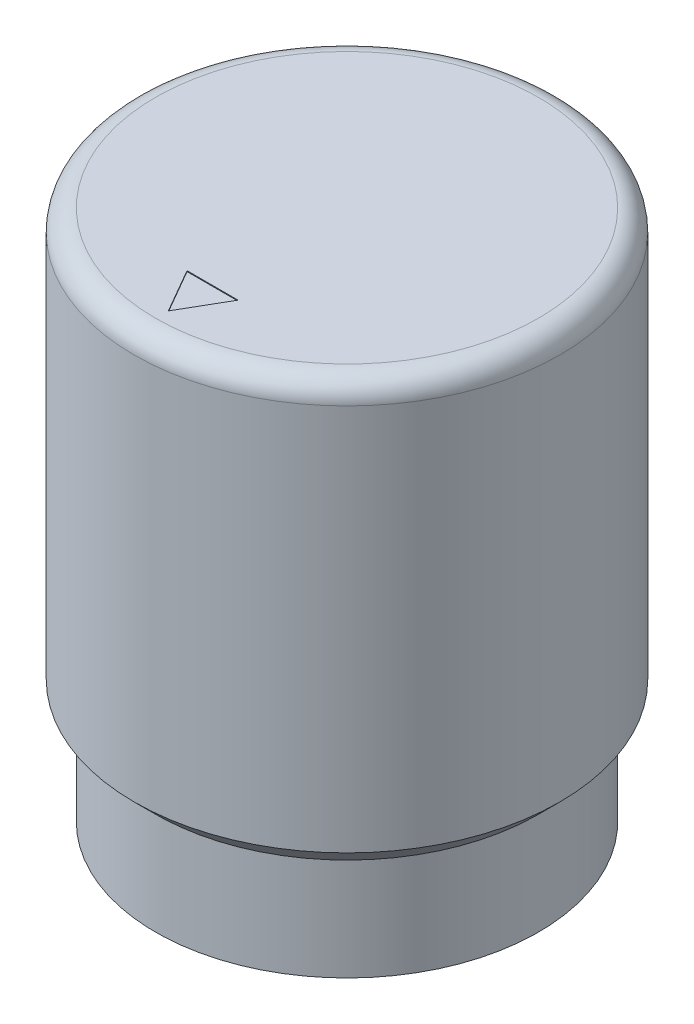
ISO-10303-21;
HEADER;
FILE_DESCRIPTION(('STEP AP214'),'2;1');
FILE_NAME('part.step','',(''),(''),'','','');
FILE_SCHEMA(('AUTOMOTIVE_DESIGN { 1 0 10303 214 1 1 1 1 }'));
ENDSEC;
DATA;
#1=APPLICATION_CONTEXT('core data for automotive mechanical design processes');
#2=APPLICATION_PROTOCOL_DEFINITION('international standard','automotive_design',2000,#1);
#3=PRODUCT_CONTEXT('',#1,'mechanical');
#4=PRODUCT('Part','Part','',(#3));
#5=PRODUCT_RELATED_PRODUCT_CATEGORY('part','',(#4));
#6=PRODUCT_DEFINITION_FORMATION('','',#4);
#7=PRODUCT_DEFINITION_CONTEXT('part definition',#1,'design');
#8=PRODUCT_DEFINITION('design','',#6,#7);
#9=PRODUCT_DEFINITION_SHAPE('','',#8);
#10=(LENGTH_UNIT() NAMED_UNIT(*) SI_UNIT(.MILLI.,.METRE.));
#11=(NAMED_UNIT(*) PLANE_ANGLE_UNIT() SI_UNIT($,.RADIAN.));
#12=(NAMED_UNIT(*) SI_UNIT($,.STERADIAN.) SOLID_ANGLE_UNIT());
#13=UNCERTAINTY_MEASURE_WITH_UNIT(LENGTH_MEASURE(1.E-05),#10,'distance_accuracy_value','');
#14=(GEOMETRIC_REPRESENTATION_CONTEXT(3) GLOBAL_UNCERTAINTY_ASSIGNED_CONTEXT((#13)) GLOBAL_UNIT_ASSIGNED_CONTEXT((#10,
#11,#12)) REPRESENTATION_CONTEXT('',''));
#15=CARTESIAN_POINT('',(0.,0.,0.));
#16=DIRECTION('',(0.,0.,1.));
#17=DIRECTION('',(1.,0.,0.));
#18=AXIS2_PLACEMENT_3D('',#15,#16,#17);
#19=CARTESIAN_POINT('',(0.,15.875,0.));
#20=DIRECTION('',(0.,1.,0.));
#21=DIRECTION('',(0.,0.,1.));
#22=AXIS2_PLACEMENT_3D('',#19,#20,#21);
#23=PLANE('',#22);
#24=DIRECTION('',(0.5,0.,-0.866025403784438));
#25=VECTOR('',#24,1.);
#26=CARTESIAN_POINT('',(0.762,15.875,4.01417728463252));
#27=LINE('',#26,#25);
#28=CARTESIAN_POINT('',(0.,15.875,5.334));
#29=VERTEX_POINT('',#28);
#30=CARTESIAN_POINT('',(0.762,15.875,4.01417728463252));
#31=VERTEX_POINT('',#30);
#32=EDGE_CURVE('E54',#29,#31,#27,.T.);
#33=ORIENTED_EDGE('',*,*,#32,.F.);
#34=DIRECTION('',(0.5,0.,0.866025403784438));
#35=VECTOR('',#34,1.);
#36=CARTESIAN_POINT('',(0.,15.875,5.334));
#37=LINE('',#36,#35);
#38=CARTESIAN_POINT('',(-0.762,15.875,4.01417728463252));
#39=VERTEX_POINT('',#38);
#40=EDGE_CURVE('E91',#39,#29,#37,.T.);
#41=ORIENTED_EDGE('',*,*,#40,.F.);
#42=DIRECTION('',(-1.,0.,0.));
#43=VECTOR('',#42,1.);
#44=CARTESIAN_POINT('',(-0.762,15.875,4.01417728463252));
#45=LINE('',#44,#43);
#46=EDGE_CURVE('E94',#31,#39,#45,.T.);
#47=ORIENTED_EDGE('',*,*,#46,.F.);
#48=EDGE_LOOP('',(#33,#41,#47));
#49=FACE_BOUND('',#48,.T.);
#50=CARTESIAN_POINT('',(0.,15.875,0.));
#51=DIRECTION('',(0.,1.,0.));
#52=DIRECTION('',(0.,0.,1.));
#53=AXIS2_PLACEMENT_3D('',#50,#51,#52);
#54=CIRCLE('',#53,5.715);
#55=CARTESIAN_POINT('',(0.,15.875,5.715));
#56=VERTEX_POINT('',#55);
#57=EDGE_CURVE('E11',#56,#56,#54,.T.);
#58=ORIENTED_EDGE('',*,*,#57,.T.);
#59=EDGE_LOOP('',(#58));
#60=FACE_BOUND('',#59,.T.);
#61=ADVANCED_FACE('F39',(#49,#60),#23,.T.);
#62=CARTESIAN_POINT('',(0.,0.,0.));
#63=DIRECTION('',(0.,-1.,0.));
#64=DIRECTION('',(0.,0.,-1.));
#65=AXIS2_PLACEMENT_3D('',#62,#63,#64);
#66=CYLINDRICAL_SURFACE('',#65,6.35);
#67=CARTESIAN_POINT('',(0.,15.24,0.));
#68=DIRECTION('',(0.,1.,0.));
#69=DIRECTION('',(0.,0.,1.));
#70=AXIS2_PLACEMENT_3D('',#67,#68,#69);
#71=CIRCLE('',#70,6.35);
#72=CARTESIAN_POINT('',(0.,15.24,6.35));
#73=VERTEX_POINT('',#72);
#74=EDGE_CURVE('E47',#73,#73,#71,.F.);
#75=ORIENTED_EDGE('',*,*,#74,.T.);
#76=EDGE_LOOP('',(#75));
#77=FACE_BOUND('',#76,.T.);
#78=CARTESIAN_POINT('',(0.,8.59155,-6.35));
#79=CARTESIAN_POINT('',(0.0750646140818434,8.59154737073417,-6.34999861096237));
#80=CARTESIAN_POINT('',(0.150161450028055,8.58527992657758,-6.34865540088408));
#81=CARTESIAN_POINT('',(0.298225296339674,8.56039984164008,-6.34342675076645));
#82=CARTESIAN_POINT('',(0.371190689529798,8.54177806894851,-6.33953943023363));
#83=CARTESIAN_POINT('',(0.512830125656907,8.492796439198,-6.32965577699744));
#84=CARTESIAN_POINT('',(0.581508452531715,8.46244852510907,-6.32366159067733));
#85=CARTESIAN_POINT('',(0.712795420037443,8.3909132358319,-6.31021261659612));
#86=CARTESIAN_POINT('',(0.77540428133116,8.34972625491349,-6.30275788196482));
#87=CARTESIAN_POINT('',(0.893733729529973,8.25701641240627,-6.28707845908267));
#88=CARTESIAN_POINT('',(0.949348399501573,8.20535989745548,-6.27884463503177));
#89=CARTESIAN_POINT('',(1.05119276861777,8.09346437873646,-6.26260005999281));
#90=CARTESIAN_POINT('',(1.09742166485733,8.03322464146688,-6.25458932813968));
#91=CARTESIAN_POINT('',(1.17964434517394,7.90509621196687,-6.23960815322762));
#92=CARTESIAN_POINT('',(1.21552634219633,7.837134290983,-6.23264943245589));
#93=CARTESIAN_POINT('',(1.27531989778063,7.69597282167515,-6.22069088315544));
#94=CARTESIAN_POINT('',(1.29923280847738,7.62277386604163,-6.21569083337163));
#95=CARTESIAN_POINT('',(1.33406128746238,7.47436223184559,-6.20830861045501));
#96=CARTESIAN_POINT('',(1.34516385912344,7.39919534927045,-6.20588881195717));
#97=CARTESIAN_POINT('',(1.35463777151121,7.24802984251258,-6.20382799290792));
#98=CARTESIAN_POINT('',(1.35301059361624,7.17203131613722,-6.20418664902391));
#99=CARTESIAN_POINT('',(1.33722190727113,7.02274306124383,-6.20760811333917));
#100=CARTESIAN_POINT('',(1.32327672735781,6.94942922291285,-6.2106242486392));
#101=CARTESIAN_POINT('',(1.28359022137343,6.80620610345467,-6.21894713261562));
#102=CARTESIAN_POINT('',(1.25784826428298,6.73629700467113,-6.22425400382448));
#103=CARTESIAN_POINT('',(1.19509780651165,6.60125487729554,-6.23660694361686));
#104=CARTESIAN_POINT('',(1.15800532064544,6.53616210229017,-6.24366590013669));
#105=CARTESIAN_POINT('',(1.07366584098501,6.41304430904634,-6.25871962533894));
#106=CARTESIAN_POINT('',(1.02641753096658,6.35502020845719,-6.2667145152598));
#107=CARTESIAN_POINT('',(0.921958343447951,6.24644048769627,-6.2829401548711));
#108=CARTESIAN_POINT('',(0.864563295807785,6.19606210282791,-6.29117238219288));
#109=CARTESIAN_POINT('',(0.742047254963458,6.10561794179964,-6.30679580872777));
#110=CARTESIAN_POINT('',(0.676926135506121,6.06555233419665,-6.31418699419339));
#111=CARTESIAN_POINT('',(0.5405963046733,5.99683073935462,-6.32731762757995));
#112=CARTESIAN_POINT('',(0.46937602644303,5.96819704156644,-6.33305384273191));
#113=CARTESIAN_POINT('',(0.322985870928896,5.92335198574641,-6.34220404917476));
#114=CARTESIAN_POINT('',(0.247816539193656,5.90713891664289,-6.34561836032498));
#115=CARTESIAN_POINT('',(0.0971831975907128,5.88785097050666,-6.34969483950221));
#116=CARTESIAN_POINT('',(0.0217515388494177,5.88453385095834,-6.35040774522148));
#117=CARTESIAN_POINT('',(-0.128588082469588,5.89047669974056,-6.34914287490065));
#118=CARTESIAN_POINT('',(-0.203496078330148,5.89973586130961,-6.34716527145521));
#119=CARTESIAN_POINT('',(-0.349866034457529,5.93036743385906,-6.34077352324428));
#120=CARTESIAN_POINT('',(-0.421355609891958,5.95161365582203,-6.33638477329703));
#121=CARTESIAN_POINT('',(-0.559756726901239,6.00547686686692,-6.32566160887462));
#122=CARTESIAN_POINT('',(-0.626667892088092,6.03809478946832,-6.319327034669));
#123=CARTESIAN_POINT('',(-0.755020804805226,6.11428628571363,-6.30528928586047));
#124=CARTESIAN_POINT('',(-0.816375459390216,6.1580032828613,-6.29756861532476));
#125=CARTESIAN_POINT('',(-0.930964829041667,6.2549621104687,-6.28165242253472));
#126=CARTESIAN_POINT('',(-0.984198546279221,6.3082051096557,-6.2734568420981));
#127=CARTESIAN_POINT('',(-1.08198553722146,6.42381349998989,-6.2573405892671));
#128=CARTESIAN_POINT('',(-1.1263715051453,6.48632160373991,-6.2494271894923));
#129=CARTESIAN_POINT('',(-1.20401575994887,6.61804773091925,-6.23493483661359));
#130=CARTESIAN_POINT('',(-1.23727451894148,6.68726546950682,-6.22835582689793));
#131=CARTESIAN_POINT('',(-1.29150180342355,6.83008031915002,-6.21733781696005));
#132=CARTESIAN_POINT('',(-1.31253798284658,6.90365079056797,-6.21288706126121));
#133=CARTESIAN_POINT('',(-1.34192355845653,7.05338861944233,-6.2066070485769));
#134=CARTESIAN_POINT('',(-1.35027486356241,7.12955558439385,-6.20477739714954));
#135=CARTESIAN_POINT('',(-1.35397567572369,7.28063973219357,-6.20397068907972));
#136=CARTESIAN_POINT('',(-1.34959015346798,7.35555023703136,-6.20493549674238));
#137=CARTESIAN_POINT('',(-1.32853178134123,7.50353887630111,-6.2094780181016));
#138=CARTESIAN_POINT('',(-1.31185906106091,7.57661703005012,-6.21305570424062));
#139=CARTESIAN_POINT('',(-1.26682455867663,7.71866923948335,-6.22239325528924));
#140=CARTESIAN_POINT('',(-1.23849943440763,7.78765539651984,-6.22814627217719));
#141=CARTESIAN_POINT('',(-1.17099639387991,7.91993635025732,-6.24118930990987));
#142=CARTESIAN_POINT('',(-1.13181741499343,7.98323058889684,-6.24847948123034));
#143=CARTESIAN_POINT('',(-1.04283172893201,8.10364141782745,-6.26395040356261));
#144=CARTESIAN_POINT('',(-0.992835380639868,8.16061603459636,-6.27214556837561));
#145=CARTESIAN_POINT('',(-0.884020822113276,8.26545398581748,-6.2884042122436));
#146=CARTESIAN_POINT('',(-0.825200580420684,8.31331521639077,-6.29646766049922));
#147=CARTESIAN_POINT('',(-0.699546337421048,8.39912290218367,-6.31167047796941));
#148=CARTESIAN_POINT('',(-0.632623562218123,8.43694167619792,-6.31879741398043));
#149=CARTESIAN_POINT('',(-0.493235348200114,8.50073467200623,-6.33120028356375));
#150=CARTESIAN_POINT('',(-0.420774730811316,8.52671906305292,-6.33647780542986));
#151=CARTESIAN_POINT('',(-0.2901768273112,8.56134743478013,-6.34361905124058));
#152=CARTESIAN_POINT('',(-0.232758269670466,8.57265224038747,-6.3459973461906));
#153=CARTESIAN_POINT('',(-0.11689962831609,8.58775439627314,-6.34918833005957));
#154=CARTESIAN_POINT('',(-0.058459585666748,8.59155204764645,-6.35000108176889));
#155=CARTESIAN_POINT('',(0.,8.59155,-6.35));
#156=B_SPLINE_CURVE_WITH_KNOTS('',3,(#78,#79,#80,#81,#82,#83,#84,#85,#86,#87,#88,#89,#90,#91,
#92,#93,#94,#95,#96,#97,#98,#99,#100,#101,#102,#103,#104,#105,#106,#107,#108,#109,#110,#111,
#112,#113,#114,#115,#116,#117,#118,#119,#120,#121,#122,#123,#124,#125,#126,#127,#128,#129,#130,
#131,#132,#133,#134,#135,#136,#137,#138,#139,#140,#141,#142,#143,#144,#145,#146,#147,#148,#149,
#150,#151,#152,#153,#154,#155),.UNSPECIFIED.,.T.,.F.,(4,2,2,2,2,2,2,2,2,2,2,2,2,2,2,2,2,2,2,2,2,
2,2,2,2,2,2,2,2,2,2,2,2,2,2,2,2,2,4),(0.,0.224979895980791,0.450126275209805,0.675043946749969,
0.899953438065849,1.12793886928433,1.355943795283,1.58632693132888,1.81668403536191,
2.04363409247309,2.27055773948938,2.49357367370591,2.71660153862233,2.94132126356156,
3.16607013040717,3.39542056996827,3.62477475790389,3.85457397221981,4.08434152359174,
4.3097715649296,4.53518714573762,4.75827288077634,4.98137693356216,5.20752538847284,
5.43370160816211,5.66381649384172,5.89392161481026,6.12274062574888,6.35152519880279,
6.57558456164185,6.79964156140387,7.02299901575426,7.24637834526044,7.47404733340156,
7.70176881671732,7.93226022587937,8.16255319898055,8.33777236451397,8.51298450226033),.UNSPECIFIED.);
#157=CARTESIAN_POINT('',(0.,8.59155,-6.35));
#158=VERTEX_POINT('',#157);
#159=EDGE_CURVE('E111',#158,#158,#156,.T.);
#160=ORIENTED_EDGE('',*,*,#159,.F.);
#161=EDGE_LOOP('',(#160));
#162=FACE_BOUND('',#161,.T.);
#163=CARTESIAN_POINT('',(0.,3.683,0.));
#164=DIRECTION('',(0.,-1.,0.));
#165=DIRECTION('',(0.,0.,-1.));
#166=AXIS2_PLACEMENT_3D('',#163,#164,#165);
#167=CIRCLE('',#166,6.35);
#168=CARTESIAN_POINT('',(0.,3.683,-6.35));
#169=VERTEX_POINT('',#168);
#170=EDGE_CURVE('E198',#169,#169,#167,.T.);
#171=ORIENTED_EDGE('',*,*,#170,.F.);
#172=EDGE_LOOP('',(#171));
#173=FACE_BOUND('',#172,.T.);
#174=ADVANCED_FACE('F138',(#77,#162,#173),#66,.T.);
#175=CARTESIAN_POINT('',(0.,3.048,0.));
#176=DIRECTION('',(0.,1.,0.));
#177=DIRECTION('',(0.,0.,1.));
#178=AXIS2_PLACEMENT_3D('',#175,#176,#177);
#179=CONICAL_SURFACE('',#178,5.715,0.785398163397451);
#180=ORIENTED_EDGE('',*,*,#170,.T.);
#181=EDGE_LOOP('',(#180));
#182=FACE_BOUND('',#181,.T.);
#183=CARTESIAN_POINT('',(0.,3.048,0.));
#184=DIRECTION('',(0.,-1.,0.));
#185=DIRECTION('',(0.,0.,-1.));
#186=AXIS2_PLACEMENT_3D('',#183,#184,#185);
#187=CIRCLE('',#186,5.715);
#188=CARTESIAN_POINT('',(0.,3.048,-5.715));
#189=VERTEX_POINT('',#188);
#190=EDGE_CURVE('E195',#189,#189,#187,.T.);
#191=ORIENTED_EDGE('',*,*,#190,.F.);
#192=EDGE_LOOP('',(#191));
#193=FACE_BOUND('',#192,.T.);
#194=ADVANCED_FACE('F143',(#182,#193),#179,.T.);
#195=CARTESIAN_POINT('',(0.,0.,0.));
#196=DIRECTION('',(0.,-1.,0.));
#197=DIRECTION('',(0.,0.,-1.));
#198=AXIS2_PLACEMENT_3D('',#195,#196,#197);
#199=CYLINDRICAL_SURFACE('',#198,5.715);
#200=ORIENTED_EDGE('',*,*,#190,.T.);
#201=EDGE_LOOP('',(#200));
#202=FACE_BOUND('',#201,.T.);
#203=CARTESIAN_POINT('',(0.,0.,0.));
#204=DIRECTION('',(0.,-1.,0.));
#205=DIRECTION('',(0.,0.,-1.));
#206=AXIS2_PLACEMENT_3D('',#203,#204,#205);
#207=CIRCLE('',#206,5.715);
#208=CARTESIAN_POINT('',(0.,0.,-5.715));
#209=VERTEX_POINT('',#208);
#210=EDGE_CURVE('E192',#209,#209,#207,.T.);
#211=ORIENTED_EDGE('',*,*,#210,.F.);
#212=EDGE_LOOP('',(#211));
#213=FACE_BOUND('',#212,.T.);
#214=ADVANCED_FACE('F150',(#202,#213),#199,.T.);
#215=CARTESIAN_POINT('',(5.715,0.,0.));
#216=DIRECTION('',(0.,-1.,0.));
#217=DIRECTION('',(0.,0.,-1.));
#218=AXIS2_PLACEMENT_3D('',#215,#216,#217);
#219=PLANE('',#218);
#220=ORIENTED_EDGE('',*,*,#210,.T.);
#221=EDGE_LOOP('',(#220));
#222=FACE_BOUND('',#221,.T.);
#223=CARTESIAN_POINT('',(0.,0.,0.));
#224=DIRECTION('',(0.,-1.,0.));
#225=DIRECTION('',(0.,0.,-1.));
#226=AXIS2_PLACEMENT_3D('',#223,#224,#225);
#227=CIRCLE('',#226,4.7625);
#228=CARTESIAN_POINT('',(0.,0.,-4.7625));
#229=VERTEX_POINT('',#228);
#230=EDGE_CURVE('E189',#229,#229,#227,.T.);
#231=ORIENTED_EDGE('',*,*,#230,.F.);
#232=EDGE_LOOP('',(#231));
#233=FACE_BOUND('',#232,.T.);
#234=ADVANCED_FACE('F154',(#222,#233),#219,.T.);
#235=CARTESIAN_POINT('',(0.,0.,0.));
#236=DIRECTION('',(0.,-1.,0.));
#237=DIRECTION('',(0.,0.,-1.));
#238=AXIS2_PLACEMENT_3D('',#235,#236,#237);
#239=CYLINDRICAL_SURFACE('',#238,4.7625);
#240=ORIENTED_EDGE('',*,*,#230,.T.);
#241=EDGE_LOOP('',(#240));
#242=FACE_BOUND('',#241,.T.);
#243=CARTESIAN_POINT('',(0.,3.9878,0.));
#244=DIRECTION('',(0.,-1.,0.));
#245=DIRECTION('',(0.,0.,-1.));
#246=AXIS2_PLACEMENT_3D('',#243,#244,#245);
#247=CIRCLE('',#246,4.7625);
#248=CARTESIAN_POINT('',(0.,3.9878,-4.7625));
#249=VERTEX_POINT('',#248);
#250=EDGE_CURVE('E183',#249,#249,#247,.T.);
#251=ORIENTED_EDGE('',*,*,#250,.F.);
#252=EDGE_LOOP('',(#251));
#253=FACE_BOUND('',#252,.T.);
#254=ADVANCED_FACE('F158',(#242,#253),#239,.F.);
#255=CARTESIAN_POINT('',(4.7625,3.9878,0.));
#256=DIRECTION('',(0.,-1.,0.));
#257=DIRECTION('',(0.,0.,-1.));
#258=AXIS2_PLACEMENT_3D('',#255,#256,#257);
#259=PLANE('',#258);
#260=CARTESIAN_POINT('',(0.,3.9878,0.));
#261=DIRECTION('',(0.,-1.,0.));
#262=DIRECTION('',(0.,0.,-1.));
#263=AXIS2_PLACEMENT_3D('',#260,#261,#262);
#264=CIRCLE('',#263,1.5875);
#265=CARTESIAN_POINT('',(0.,3.9878,-1.5875));
#266=VERTEX_POINT('',#265);
#267=EDGE_CURVE('E178',#266,#266,#264,.T.);
#268=ORIENTED_EDGE('',*,*,#267,.F.);
#269=EDGE_LOOP('',(#268));
#270=FACE_BOUND('',#269,.T.);
#271=ORIENTED_EDGE('',*,*,#250,.T.);
#272=EDGE_LOOP('',(#271));
#273=FACE_BOUND('',#272,.T.);
#274=ADVANCED_FACE('F162',(#270,#273),#259,.T.);
#275=CARTESIAN_POINT('',(0.,12.954,0.));
#276=DIRECTION('',(0.,-1.,0.));
#277=DIRECTION('',(0.,0.,-1.));
#278=AXIS2_PLACEMENT_3D('',#275,#276,#277);
#279=CONICAL_SURFACE('',#278,1.5875,1.02974425867665);
#280=CARTESIAN_POINT('',(0.,13.9078662327063,0.));
#281=VERTEX_POINT('',#280);
#282=VERTEX_LOOP('',#281);
#283=FACE_BOUND('',#282,.T.);
#284=CARTESIAN_POINT('',(0.,12.954,0.));
#285=DIRECTION('',(0.,-1.,0.));
#286=DIRECTION('',(0.,0.,-1.));
#287=AXIS2_PLACEMENT_3D('',#284,#285,#286);
#288=CIRCLE('',#287,1.5875);
#289=CARTESIAN_POINT('',(0.,12.954,-1.5875));
#290=VERTEX_POINT('',#289);
#291=EDGE_CURVE('E181',#290,#290,#288,.T.);
#292=ORIENTED_EDGE('',*,*,#291,.T.);
#293=EDGE_LOOP('',(#292));
#294=FACE_BOUND('',#293,.T.);
#295=ADVANCED_FACE('F166',(#283,#294),#279,.F.);
#296=CARTESIAN_POINT('',(0.,0.,0.));
#297=DIRECTION('',(0.,-1.,0.));
#298=DIRECTION('',(0.,0.,-1.));
#299=AXIS2_PLACEMENT_3D('',#296,#297,#298);
#300=CYLINDRICAL_SURFACE('',#299,1.5875);
#301=CARTESIAN_POINT('',(0.,8.59155,-1.5875));
#302=CARTESIAN_POINT('',(0.0637557801867504,8.59154446129415,-1.58749457189573));
#303=CARTESIAN_POINT('',(0.127584395650742,8.58700412042864,-1.58362139697616));
#304=CARTESIAN_POINT('',(0.253145411756658,8.56916892897747,-1.56846836652989));
#305=CARTESIAN_POINT('',(0.314873874090991,8.5558584916587,-1.55717532407759));
#306=CARTESIAN_POINT('',(0.434068708639586,8.52149742050144,-1.52822742870683));
#307=CARTESIAN_POINT('',(0.491559928370429,8.50049709374969,-1.51061393869737));
#308=CARTESIAN_POINT('',(0.601656805584444,8.45186003178491,-1.47024200809933));
#309=CARTESIAN_POINT('',(0.654261732623575,8.42422230656487,-1.44748280002633));
#310=CARTESIAN_POINT('',(0.772937141682822,8.35185427142569,-1.38874100891734));
#311=CARTESIAN_POINT('',(0.836607853922579,8.30460812189119,-1.35100789664626));
#312=CARTESIAN_POINT('',(0.953500430390388,8.20146448153975,-1.27123111800066));
#313=CARTESIAN_POINT('',(1.00669282413287,8.14554335901386,-1.22917578624323));
#314=CARTESIAN_POINT('',(1.10357671713246,8.02489013960786,-1.14303583440814));
#315=CARTESIAN_POINT('',(1.14705700109056,7.96000423666564,-1.09892745307307));
#316=CARTESIAN_POINT('',(1.20388151857638,7.85673329383009,-1.03520190716905));
#317=CARTESIAN_POINT('',(1.22141508688899,7.82134406719063,-1.01437889263476));
#318=CARTESIAN_POINT('',(1.25358365447252,7.7484192957033,-0.974340856745057));
#319=CARTESIAN_POINT('',(1.26822103031857,7.71088554349547,-0.955124524509192));
#320=CARTESIAN_POINT('',(1.29522317610988,7.63101640805583,-0.918209613113041));
#321=CARTESIAN_POINT('',(1.30738272636792,7.58852745864177,-0.900686705872855));
#322=CARTESIAN_POINT('',(1.32769354699902,7.50097811742207,-0.870470550116207));
#323=CARTESIAN_POINT('',(1.33585347517471,7.45592351763273,-0.857766883211672));
#324=CARTESIAN_POINT('',(1.34766702526835,7.36308071813296,-0.839095803976714));
#325=CARTESIAN_POINT('',(1.35125420302449,7.31526253915226,-0.833227820196492));
#326=CARTESIAN_POINT('',(1.3532556487291,7.21923949783911,-0.829977355509737));
#327=CARTESIAN_POINT('',(1.35167395734488,7.17103496692474,-0.832588246390661));
#328=CARTESIAN_POINT('',(1.34416788950154,7.08324986715905,-0.844631535697278));
#329=CARTESIAN_POINT('',(1.33892177141299,7.04344987639273,-0.852995748255254));
#330=CARTESIAN_POINT('',(1.32521944234796,6.96559638698333,-0.874133836852169));
#331=CARTESIAN_POINT('',(1.31675801566171,6.92754583921982,-0.886914874572257));
#332=CARTESIAN_POINT('',(1.28876844533604,6.82255973805525,-0.927485590733394));
#333=CARTESIAN_POINT('',(1.26589130528161,6.75794631472438,-0.958912397998081));
#334=CARTESIAN_POINT('',(1.21195162034915,6.63476085807221,-1.02626254780933));
#335=CARTESIAN_POINT('',(1.18086401948294,6.57620809478573,-1.06219947469982));
#336=CARTESIAN_POINT('',(1.10824253197076,6.46041018388281,-1.13794404435972));
#337=CARTESIAN_POINT('',(1.06609214061857,6.40360646626894,-1.17783768563982));
#338=CARTESIAN_POINT('',(0.972851032947867,6.2966768056385,-1.25595271750481));
#339=CARTESIAN_POINT('',(0.921771456283821,6.24654267758776,-1.29417611839899));
#340=CARTESIAN_POINT('',(0.81479893634055,6.15735030830167,-1.3638256050152));
#341=CARTESIAN_POINT('',(0.759563476069498,6.11774080445463,-1.39554724085709));
#342=CARTESIAN_POINT('',(0.641630622116439,6.04634019607523,-1.45353684429932));
#343=CARTESIAN_POINT('',(0.578940573135137,6.01454148906956,-1.47981011104227));
#344=CARTESIAN_POINT('',(0.458234657896244,5.96506310318264,-1.52102836417675));
#345=CARTESIAN_POINT('',(0.401228212010102,5.9459037143313,-1.53713874322711));
#346=CARTESIAN_POINT('',(0.283828222525983,5.9151775436252,-1.56307458708343));
#347=CARTESIAN_POINT('',(0.22343709699883,5.9036054145052,-1.57290447805755));
#348=CARTESIAN_POINT('',(0.100641273146682,5.88877747482633,-1.58551257057517));
#349=CARTESIAN_POINT('',(0.0382293028369609,5.88555613041063,-1.58826154680637));
#350=CARTESIAN_POINT('',(-0.086327232273963,5.88777150510452,-1.58637411563069));
#351=CARTESIAN_POINT('',(-0.148471798990223,5.8932081621045,-1.58173776120372));
#352=CARTESIAN_POINT('',(-0.266508166452847,5.91170875579809,-1.56602842636005));
#353=CARTESIAN_POINT('',(-0.3225432843419,5.92425145567009,-1.55539552159358));
#354=CARTESIAN_POINT('',(-0.431393655301287,5.95583686302227,-1.5287906099904));
#355=CARTESIAN_POINT('',(-0.484207954862729,5.97488148446277,-1.5128170310566));
#356=CARTESIAN_POINT('',(-0.602536432865162,6.02584521476183,-1.47045700620169));
#357=CARTESIAN_POINT('',(-0.666507984438014,6.05993868596274,-1.44237374245444));
#358=CARTESIAN_POINT('',(-0.786440557738496,6.13628423552284,-1.38066817130807));
#359=CARTESIAN_POINT('',(-0.842383275904157,6.17855445571529,-1.3470335719244));
#360=CARTESIAN_POINT('',(-0.959257213017076,6.28153267548124,-1.26734272197341));
#361=CARTESIAN_POINT('',(-1.01781348990302,6.34419244516691,-1.22030791992751));
#362=CARTESIAN_POINT('',(-1.09585867993603,6.44509043743967,-1.14912984559645));
#363=CARTESIAN_POINT('',(-1.120253276624,6.4798962297127,-1.12528578583038));
#364=CARTESIAN_POINT('',(-1.16577950578336,6.55186031565273,-1.07804785296253));
#365=CARTESIAN_POINT('',(-1.18691276429792,6.58901742388128,-1.05465376064159));
#366=CARTESIAN_POINT('',(-1.23042905587509,6.67484512610341,-1.00377566688064));
#367=CARTESIAN_POINT('',(-1.25193425867196,6.72416633718603,-0.976626010767769));
#368=CARTESIAN_POINT('',(-1.28939589800484,6.8268994230734,-0.926599160451213));
#369=CARTESIAN_POINT('',(-1.30536480857007,6.88030176651655,-0.903712415921721));
#370=CARTESIAN_POINT('',(-1.3274868309936,6.97649549911353,-0.870759536170485));
#371=CARTESIAN_POINT('',(-1.33512245367011,7.01831161877498,-0.858901824883155));
#372=CARTESIAN_POINT('',(-1.34644659774743,7.10366384241014,-0.841042998909302));
#373=CARTESIAN_POINT('',(-1.3501445387511,7.14719558220637,-0.83502791072024));
#374=CARTESIAN_POINT('',(-1.35326256291525,7.23511701369336,-0.829969110934594));
#375=CARTESIAN_POINT('',(-1.35265582461229,7.27951036279137,-0.830969108283159));
#376=CARTESIAN_POINT('',(-1.34716814873848,7.36735807542695,-0.839831747360799));
#377=CARTESIAN_POINT('',(-1.34227997754604,7.41081072223854,-0.847706003301843));
#378=CARTESIAN_POINT('',(-1.3265396687326,7.50894805036278,-0.872188820891871));
#379=CARTESIAN_POINT('',(-1.31430147319789,7.56290107721783,-0.890757461820554));
#380=CARTESIAN_POINT('',(-1.28423675126972,7.66687362892035,-0.933584642185807));
#381=CARTESIAN_POINT('',(-1.26639076326535,7.71687868454949,-0.957862921716445));
#382=CARTESIAN_POINT('',(-1.21308879327782,7.84316479990228,-1.02536785036486));
#383=CARTESIAN_POINT('',(-1.17358300592935,7.9164489873327,-1.07098926409804));
#384=CARTESIAN_POINT('',(-1.08233922935241,8.05432723123638,-1.16316381803901));
#385=CARTESIAN_POINT('',(-1.03058360911153,8.11890854955754,-1.20971821183877));
#386=CARTESIAN_POINT('',(-0.913311742023997,8.24027219595242,-1.30064022486283));
#387=CARTESIAN_POINT('',(-0.847488200483939,8.29682348531529,-1.344925835164));
#388=CARTESIAN_POINT('',(-0.703061200895087,8.39778721079272,-1.42570981191692));
#389=CARTESIAN_POINT('',(-0.624503692447104,8.44224180680472,-1.46223512468553));
#390=CARTESIAN_POINT('',(-0.486094698795742,8.50257486285914,-1.51235490793656));
#391=CARTESIAN_POINT('',(-0.429484571342015,8.52299691894416,-1.52948819266801));
#392=CARTESIAN_POINT('',(-0.312674228089971,8.55630399171061,-1.55755334049984));
#393=CARTESIAN_POINT('',(-0.252482799877407,8.56920668144797,-1.56849974302432));
#394=CARTESIAN_POINT('',(-0.159796764323326,8.58245689510771,-1.5797583647557));
#395=CARTESIAN_POINT('',(-0.128012244606146,8.58585861598947,-1.58265328437851));
#396=CARTESIAN_POINT('',(-0.0641580159285817,8.59040686415061,-1.58652572466248));
#397=CARTESIAN_POINT('',(-0.0320882329192748,8.5915527876262,-1.58750273196051));
#398=CARTESIAN_POINT('',(0.,8.59155,-1.5875));
#399=B_SPLINE_CURVE_WITH_KNOTS('',3,(#301,#302,#303,#304,#305,#306,#307,#308,#309,#310,#311,
#312,#313,#314,#315,#316,#317,#318,#319,#320,#321,#322,#323,#324,#325,#326,#327,#328,#329,#330,
#331,#332,#333,#334,#335,#336,#337,#338,#339,#340,#341,#342,#343,#344,#345,#346,#347,#348,#349,
#350,#351,#352,#353,#354,#355,#356,#357,#358,#359,#360,#361,#362,#363,#364,#365,#366,#367,#368,
#369,#370,#371,#372,#373,#374,#375,#376,#377,#378,#379,#380,#381,#382,#383,#384,#385,#386,#387,
#388,#389,#390,#391,#392,#393,#394,#395,#396,#397,#398),.UNSPECIFIED.,.T.,.F.,(4,2,2,2,2,2,2,2,
2,2,2,2,2,2,2,2,2,2,2,2,2,2,2,2,2,2,2,2,2,2,2,2,2,2,2,2,2,2,2,2,2,2,2,2,2,2,2,2,4),(0.,
0.191127280812568,0.382595163885923,0.572832215725788,0.763097660182834,1.0250902600286,
1.28780951651102,1.5557813608718,1.68959455477265,1.82329748384562,1.96555153751847,
2.10749628514801,2.25148088482203,2.39535295414659,2.51790517500864,2.64065704839828,
2.86559176230715,3.09122100774408,3.33408300270971,3.57664414843002,3.80083568048713,
4.02480812802,4.21080922748518,4.39667909783452,4.58331489525221,4.76994935381286,
4.94439673752034,5.1188955173674,5.35083772959922,5.58330058233509,5.87513354731763,
6.02121609267701,6.16722556700632,6.34762188912568,6.52760907085383,6.65952565976134,
6.79112596794787,6.92354696418981,7.05619212256148,7.23027425211087,7.40496732594984,
7.68829221433071,7.97202739493441,8.2627450850929,8.55243618457417,8.73942943003033,
8.9259813868678,9.02214985598574,9.11834406278514),.UNSPECIFIED.);
#400=CARTESIAN_POINT('',(0.,8.59155,-1.5875));
#401=VERTEX_POINT('',#400);
#402=EDGE_CURVE('E102',#401,#401,#399,.T.);
#403=ORIENTED_EDGE('',*,*,#402,.T.);
#404=EDGE_LOOP('',(#403));
#405=FACE_BOUND('',#404,.T.);
#406=ORIENTED_EDGE('',*,*,#267,.T.);
#407=EDGE_LOOP('',(#406));
#408=FACE_BOUND('',#407,.T.);
#409=ORIENTED_EDGE('',*,*,#291,.F.);
#410=EDGE_LOOP('',(#409));
#411=FACE_BOUND('',#410,.T.);
#412=ADVANCED_FACE('F123',(#405,#408,#411),#300,.F.);
#413=CARTESIAN_POINT('',(0.,7.239,-6.35));
#414=DIRECTION('',(0.,0.,-1.));
#415=DIRECTION('',(-1.,0.,0.));
#416=AXIS2_PLACEMENT_3D('',#413,#414,#415);
#417=CYLINDRICAL_SURFACE('',#416,1.35255);
#418=ORIENTED_EDGE('',*,*,#159,.T.);
#419=EDGE_LOOP('',(#418));
#420=FACE_BOUND('',#419,.T.);
#421=ORIENTED_EDGE('',*,*,#402,.F.);
#422=EDGE_LOOP('',(#421));
#423=FACE_BOUND('',#422,.T.);
#424=ADVANCED_FACE('F119',(#420,#423),#417,.F.);
#425=CARTESIAN_POINT('',(0.,15.24,0.));
#426=DIRECTION('',(0.,1.,0.));
#427=DIRECTION('',(0.,0.,1.));
#428=AXIS2_PLACEMENT_3D('',#425,#426,#427);
#429=TOROIDAL_SURFACE('',#428,5.715,0.635);
#430=ORIENTED_EDGE('',*,*,#57,.F.);
#431=EDGE_LOOP('',(#430));
#432=FACE_BOUND('',#431,.T.);
#433=ORIENTED_EDGE('',*,*,#74,.F.);
#434=EDGE_LOOP('',(#433));
#435=FACE_BOUND('',#434,.T.);
#436=ADVANCED_FACE('F41',(#432,#435),#429,.T.);
#437=CARTESIAN_POINT('',(0.762,15.8496,4.01417728463252));
#438=DIRECTION('',(0.866025403784439,0.,0.5));
#439=DIRECTION('',(0.5,0.,-0.866025403784439));
#440=AXIS2_PLACEMENT_3D('',#437,#438,#439);
#441=PLANE('',#440);
#442=ORIENTED_EDGE('',*,*,#32,.T.);
#443=DIRECTION('',(0.,1.,0.));
#444=VECTOR('',#443,1.);
#445=CARTESIAN_POINT('',(0.762,15.8496,4.01417728463252));
#446=LINE('',#445,#444);
#447=CARTESIAN_POINT('',(0.762,15.8496,4.01417728463252));
#448=VERTEX_POINT('',#447);
#449=EDGE_CURVE('E72',#448,#31,#446,.T.);
#450=ORIENTED_EDGE('',*,*,#449,.F.);
#451=DIRECTION('',(0.5,0.,-0.866025403784438));
#452=VECTOR('',#451,1.);
#453=CARTESIAN_POINT('',(0.762,15.8496,4.01417728463252));
#454=LINE('',#453,#452);
#455=CARTESIAN_POINT('',(0.,15.8496,5.334));
#456=VERTEX_POINT('',#455);
#457=EDGE_CURVE('E76',#456,#448,#454,.T.);
#458=ORIENTED_EDGE('',*,*,#457,.F.);
#459=DIRECTION('',(0.,1.,0.));
#460=VECTOR('',#459,1.);
#461=CARTESIAN_POINT('',(0.,15.8496,5.334));
#462=LINE('',#461,#460);
#463=EDGE_CURVE('E100',#456,#29,#462,.T.);
#464=ORIENTED_EDGE('',*,*,#463,.T.);
#465=EDGE_LOOP('',(#442,#450,#458,#464));
#466=FACE_BOUND('',#465,.T.);
#467=ADVANCED_FACE('F74',(#466),#441,.F.);
#468=CARTESIAN_POINT('',(0.,15.8496,5.334));
#469=DIRECTION('',(-0.866025403784439,0.,0.5));
#470=DIRECTION('',(0.5,0.,0.866025403784439));
#471=AXIS2_PLACEMENT_3D('',#468,#469,#470);
#472=PLANE('',#471);
#473=ORIENTED_EDGE('',*,*,#40,.T.);
#474=ORIENTED_EDGE('',*,*,#463,.F.);
#475=DIRECTION('',(0.5,0.,0.866025403784438));
#476=VECTOR('',#475,1.);
#477=CARTESIAN_POINT('',(0.,15.8496,5.334));
#478=LINE('',#477,#476);
#479=CARTESIAN_POINT('',(-0.762,15.8496,4.01417728463252));
#480=VERTEX_POINT('',#479);
#481=EDGE_CURVE('E82',#480,#456,#478,.T.);
#482=ORIENTED_EDGE('',*,*,#481,.F.);
#483=DIRECTION('',(0.,1.,0.));
#484=VECTOR('',#483,1.);
#485=CARTESIAN_POINT('',(-0.762,15.8496,4.01417728463252));
#486=LINE('',#485,#484);
#487=EDGE_CURVE('E81',#480,#39,#486,.T.);
#488=ORIENTED_EDGE('',*,*,#487,.T.);
#489=EDGE_LOOP('',(#473,#474,#482,#488));
#490=FACE_BOUND('',#489,.T.);
#491=ADVANCED_FACE('F128',(#490),#472,.F.);
#492=CARTESIAN_POINT('',(-0.762,15.8496,4.01417728463252));
#493=DIRECTION('',(0.,0.,-1.));
#494=DIRECTION('',(-1.,0.,0.));
#495=AXIS2_PLACEMENT_3D('',#492,#493,#494);
#496=PLANE('',#495);
#497=ORIENTED_EDGE('',*,*,#46,.T.);
#498=ORIENTED_EDGE('',*,*,#487,.F.);
#499=DIRECTION('',(-1.,0.,0.));
#500=VECTOR('',#499,1.);
#501=CARTESIAN_POINT('',(-0.762,15.8496,4.01417728463252));
#502=LINE('',#501,#500);
#503=EDGE_CURVE('E85',#448,#480,#502,.T.);
#504=ORIENTED_EDGE('',*,*,#503,.F.);
#505=ORIENTED_EDGE('',*,*,#449,.T.);
#506=EDGE_LOOP('',(#497,#498,#504,#505));
#507=FACE_BOUND('',#506,.T.);
#508=ADVANCED_FACE('F86',(#507),#496,.F.);
#509=CARTESIAN_POINT('',(0.,15.8496,0.));
#510=DIRECTION('',(0.,-1.,0.));
#511=DIRECTION('',(0.,0.,-1.));
#512=AXIS2_PLACEMENT_3D('',#509,#510,#511);
#513=PLANE('',#512);
#514=ORIENTED_EDGE('',*,*,#457,.T.);
#515=ORIENTED_EDGE('',*,*,#503,.T.);
#516=ORIENTED_EDGE('',*,*,#481,.T.);
#517=EDGE_LOOP('',(#514,#515,#516));
#518=FACE_BOUND('',#517,.T.);
#519=ADVANCED_FACE('F90',(#518),#513,.F.);
#520=CLOSED_SHELL('',(#61,#174,#194,#214,#234,#254,#274,#295,#412,#424,#436,#467,#491,#508,#519));
#521=MANIFOLD_SOLID_BREP('B2',#520);
#522=ADVANCED_BREP_SHAPE_REPRESENTATION('',(#18,#521),#14);
#523=SHAPE_DEFINITION_REPRESENTATION(#9,#522);
ENDSEC;
END-ISO-10303-21;
